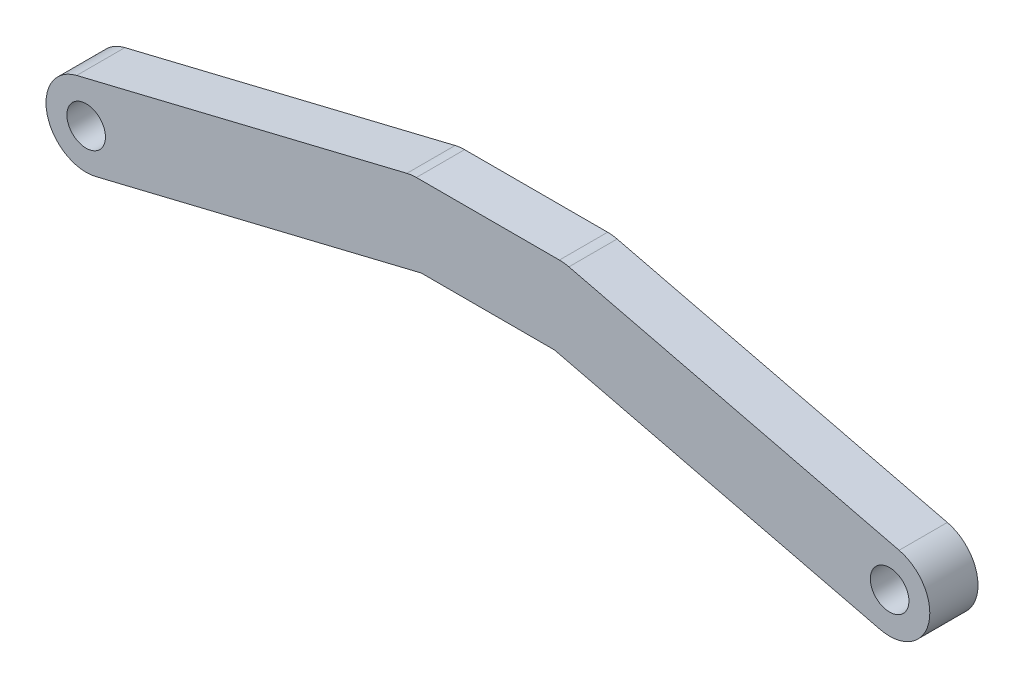
ISO-10303-21;
HEADER;
FILE_DESCRIPTION(('STEP AP214'),'2;1');
FILE_NAME('part.step','',(''),(''),'','','');
FILE_SCHEMA(('AUTOMOTIVE_DESIGN { 1 0 10303 214 1 1 1 1 }'));
ENDSEC;
DATA;
#1=APPLICATION_CONTEXT('core data for automotive mechanical design processes');
#2=APPLICATION_PROTOCOL_DEFINITION('international standard','automotive_design',2000,#1);
#3=PRODUCT_CONTEXT('',#1,'mechanical');
#4=PRODUCT('Part','Part','',(#3));
#5=PRODUCT_RELATED_PRODUCT_CATEGORY('part','',(#4));
#6=PRODUCT_DEFINITION_FORMATION('','',#4);
#7=PRODUCT_DEFINITION_CONTEXT('part definition',#1,'design');
#8=PRODUCT_DEFINITION('design','',#6,#7);
#9=PRODUCT_DEFINITION_SHAPE('','',#8);
#10=(LENGTH_UNIT() NAMED_UNIT(*) SI_UNIT(.MILLI.,.METRE.));
#11=(NAMED_UNIT(*) PLANE_ANGLE_UNIT() SI_UNIT($,.RADIAN.));
#12=(NAMED_UNIT(*) SI_UNIT($,.STERADIAN.) SOLID_ANGLE_UNIT());
#13=UNCERTAINTY_MEASURE_WITH_UNIT(LENGTH_MEASURE(1.E-05),#10,'distance_accuracy_value','');
#14=(GEOMETRIC_REPRESENTATION_CONTEXT(3) GLOBAL_UNCERTAINTY_ASSIGNED_CONTEXT((#13)) GLOBAL_UNIT_ASSIGNED_CONTEXT((#10,
#11,#12)) REPRESENTATION_CONTEXT('',''));
#15=CARTESIAN_POINT('',(0.,0.,0.));
#16=DIRECTION('',(0.,0.,1.));
#17=DIRECTION('',(1.,0.,0.));
#18=AXIS2_PLACEMENT_3D('',#15,#16,#17);
#19=CARTESIAN_POINT('',(-1.98831371703527,8.17192018402959,1.5));
#20=DIRECTION('',(-0.236413248089907,0.971652600535593,0.));
#21=DIRECTION('',(-0.971652600535593,-0.236413248089907,0.));
#22=AXIS2_PLACEMENT_3D('',#19,#20,#21);
#23=PLANE('',#22);
#24=DIRECTION('',(0.971652600535593,0.236413248089907,0.));
#25=VECTOR('',#24,1.);
#26=CARTESIAN_POINT('',(-1.98831371703527,8.17192018402959,-1.5));
#27=LINE('',#26,#25);
#28=CARTESIAN_POINT('',(-25.5910331202248,2.42913150133898,-1.5));
#29=VERTEX_POINT('',#28);
#30=CARTESIAN_POINT('',(-5.04115682551566,7.42913150133898,-1.5));
#31=VERTEX_POINT('',#30);
#32=EDGE_CURVE('E153',#29,#31,#27,.T.);
#33=ORIENTED_EDGE('',*,*,#32,.F.);
#34=DIRECTION('',(0.,0.,-1.));
#35=VECTOR('',#34,1.);
#36=CARTESIAN_POINT('',(-25.5910331202248,2.42913150133898,1.5));
#37=LINE('',#36,#35);
#38=CARTESIAN_POINT('',(-25.5910331202248,2.42913150133898,1.5));
#39=VERTEX_POINT('',#38);
#40=EDGE_CURVE('E11',#39,#29,#37,.T.);
#41=ORIENTED_EDGE('',*,*,#40,.F.);
#42=DIRECTION('',(0.971652600535593,0.236413248089907,0.));
#43=VECTOR('',#42,1.);
#44=CARTESIAN_POINT('',(-1.98831371703527,8.17192018402959,1.5));
#45=LINE('',#44,#43);
#46=CARTESIAN_POINT('',(-5.04115682551566,7.42913150133898,1.5));
#47=VERTEX_POINT('',#46);
#48=EDGE_CURVE('E180',#39,#47,#45,.T.);
#49=ORIENTED_EDGE('',*,*,#48,.T.);
#50=DIRECTION('',(0.,0.,-1.));
#51=VECTOR('',#50,1.);
#52=CARTESIAN_POINT('',(-5.04115682551566,7.42913150133898,1.5));
#53=LINE('',#52,#51);
#54=EDGE_CURVE('E98',#47,#31,#53,.T.);
#55=ORIENTED_EDGE('',*,*,#54,.T.);
#56=EDGE_LOOP('',(#33,#41,#49,#55));
#57=FACE_BOUND('',#56,.T.);
#58=ADVANCED_FACE('F41',(#57),#23,.T.);
#59=CARTESIAN_POINT('',(-25.,0.,1.5));
#60=DIRECTION('',(0.,0.,-1.));
#61=DIRECTION('',(-1.,0.,0.));
#62=AXIS2_PLACEMENT_3D('',#59,#60,#61);
#63=CYLINDRICAL_SURFACE('',#62,2.5);
#64=CARTESIAN_POINT('',(-25.,0.,-1.5));
#65=DIRECTION('',(0.,0.,1.));
#66=DIRECTION('',(1.,0.,0.));
#67=AXIS2_PLACEMENT_3D('',#64,#65,#66);
#68=CIRCLE('',#67,2.5);
#69=CARTESIAN_POINT('',(-24.4089668797752,-2.42913150133898,-1.5));
#70=VERTEX_POINT('',#69);
#71=EDGE_CURVE('E156',#29,#70,#68,.T.);
#72=ORIENTED_EDGE('',*,*,#71,.T.);
#73=DIRECTION('',(0.,0.,-1.));
#74=VECTOR('',#73,1.);
#75=CARTESIAN_POINT('',(-24.4089668797752,-2.42913150133898,1.5));
#76=LINE('',#75,#74);
#77=CARTESIAN_POINT('',(-24.4089668797752,-2.42913150133898,1.5));
#78=VERTEX_POINT('',#77);
#79=EDGE_CURVE('E49',#78,#70,#76,.T.);
#80=ORIENTED_EDGE('',*,*,#79,.F.);
#81=CARTESIAN_POINT('',(-25.,0.,1.5));
#82=DIRECTION('',(0.,0.,1.));
#83=DIRECTION('',(1.,0.,0.));
#84=AXIS2_PLACEMENT_3D('',#81,#82,#83);
#85=CIRCLE('',#84,2.5);
#86=EDGE_CURVE('E220',#39,#78,#85,.T.);
#87=ORIENTED_EDGE('',*,*,#86,.F.);
#88=ORIENTED_EDGE('',*,*,#40,.T.);
#89=EDGE_LOOP('',(#72,#80,#87,#88));
#90=FACE_BOUND('',#89,.T.);
#91=ADVANCED_FACE('F235',(#90),#63,.T.);
#92=CARTESIAN_POINT('',(-0.806247476585729,3.31365718135163,1.5));
#93=DIRECTION('',(-0.236413248089907,0.971652600535593,0.));
#94=DIRECTION('',(-0.971652600535593,-0.236413248089907,0.));
#95=AXIS2_PLACEMENT_3D('',#92,#93,#94);
#96=PLANE('',#95);
#97=DIRECTION('',(0.971652600535593,0.236413248089907,0.));
#98=VECTOR('',#97,1.);
#99=CARTESIAN_POINT('',(-0.806247476585729,3.31365718135163,-1.5));
#100=LINE('',#99,#98);
#101=CARTESIAN_POINT('',(-4.15035836120124,2.5,-1.5));
#102=VERTEX_POINT('',#101);
#103=EDGE_CURVE('E158',#70,#102,#100,.T.);
#104=ORIENTED_EDGE('',*,*,#103,.T.);
#105=DIRECTION('',(0.,0.,-1.));
#106=VECTOR('',#105,1.);
#107=CARTESIAN_POINT('',(-4.15035836120124,2.5,1.5));
#108=LINE('',#107,#106);
#109=CARTESIAN_POINT('',(-4.15035836120124,2.5,1.5));
#110=VERTEX_POINT('',#109);
#111=EDGE_CURVE('E191',#110,#102,#108,.T.);
#112=ORIENTED_EDGE('',*,*,#111,.F.);
#113=DIRECTION('',(0.971652600535593,0.236413248089907,0.));
#114=VECTOR('',#113,1.);
#115=CARTESIAN_POINT('',(-0.806247476585729,3.31365718135163,1.5));
#116=LINE('',#115,#114);
#117=EDGE_CURVE('E200',#78,#110,#116,.T.);
#118=ORIENTED_EDGE('',*,*,#117,.F.);
#119=ORIENTED_EDGE('',*,*,#79,.T.);
#120=EDGE_LOOP('',(#104,#112,#118,#119));
#121=FACE_BOUND('',#120,.T.);
#122=ADVANCED_FACE('F198',(#121),#96,.F.);
#123=CARTESIAN_POINT('',(0.,2.5,1.5));
#124=DIRECTION('',(0.,1.,0.));
#125=DIRECTION('',(-1.,0.,0.));
#126=AXIS2_PLACEMENT_3D('',#123,#124,#125);
#127=PLANE('',#126);
#128=DIRECTION('',(1.,0.,0.));
#129=VECTOR('',#128,1.);
#130=CARTESIAN_POINT('',(0.,2.5,-1.5));
#131=LINE('',#130,#129);
#132=CARTESIAN_POINT('',(4.15035836120123,2.50000000000001,-1.5));
#133=VERTEX_POINT('',#132);
#134=EDGE_CURVE('E160',#102,#133,#131,.T.);
#135=ORIENTED_EDGE('',*,*,#134,.T.);
#136=DIRECTION('',(0.,0.,-1.));
#137=VECTOR('',#136,1.);
#138=CARTESIAN_POINT('',(4.15035836120123,2.50000000000001,1.5));
#139=LINE('',#138,#137);
#140=CARTESIAN_POINT('',(4.15035836120123,2.50000000000001,1.5));
#141=VERTEX_POINT('',#140);
#142=EDGE_CURVE('E189',#141,#133,#139,.T.);
#143=ORIENTED_EDGE('',*,*,#142,.F.);
#144=DIRECTION('',(1.,0.,0.));
#145=VECTOR('',#144,1.);
#146=CARTESIAN_POINT('',(0.,2.5,1.5));
#147=LINE('',#146,#145);
#148=EDGE_CURVE('E214',#110,#141,#147,.T.);
#149=ORIENTED_EDGE('',*,*,#148,.F.);
#150=ORIENTED_EDGE('',*,*,#111,.T.);
#151=EDGE_LOOP('',(#135,#143,#149,#150));
#152=FACE_BOUND('',#151,.T.);
#153=ADVANCED_FACE('F211',(#152),#127,.F.);
#154=CARTESIAN_POINT('',(0.806247476585728,3.31365718135163,1.5));
#155=DIRECTION('',(-0.236413248089906,-0.971652600535593,0.));
#156=DIRECTION('',(0.971652600535593,-0.236413248089906,0.));
#157=AXIS2_PLACEMENT_3D('',#154,#155,#156);
#158=PLANE('',#157);
#159=DIRECTION('',(-0.971652600535593,0.236413248089906,0.));
#160=VECTOR('',#159,1.);
#161=CARTESIAN_POINT('',(0.806247476585728,3.31365718135163,-1.5));
#162=LINE('',#161,#160);
#163=CARTESIAN_POINT('',(24.4089668797752,-2.42913150133897,-1.5));
#164=VERTEX_POINT('',#163);
#165=EDGE_CURVE('E163',#164,#133,#162,.T.);
#166=ORIENTED_EDGE('',*,*,#165,.F.);
#167=DIRECTION('',(0.,0.,-1.));
#168=VECTOR('',#167,1.);
#169=CARTESIAN_POINT('',(24.4089668797752,-2.42913150133897,1.5));
#170=LINE('',#169,#168);
#171=CARTESIAN_POINT('',(24.4089668797752,-2.42913150133897,1.5));
#172=VERTEX_POINT('',#171);
#173=EDGE_CURVE('E187',#172,#164,#170,.T.);
#174=ORIENTED_EDGE('',*,*,#173,.F.);
#175=DIRECTION('',(-0.971652600535593,0.236413248089906,0.));
#176=VECTOR('',#175,1.);
#177=CARTESIAN_POINT('',(0.806247476585728,3.31365718135163,1.5));
#178=LINE('',#177,#176);
#179=EDGE_CURVE('E216',#172,#141,#178,.T.);
#180=ORIENTED_EDGE('',*,*,#179,.T.);
#181=ORIENTED_EDGE('',*,*,#142,.T.);
#182=EDGE_LOOP('',(#166,#174,#180,#181));
#183=FACE_BOUND('',#182,.T.);
#184=ADVANCED_FACE('F245',(#183),#158,.T.);
#185=CARTESIAN_POINT('',(25.,0.,1.5));
#186=DIRECTION('',(0.,0.,-1.));
#187=DIRECTION('',(-1.,0.,0.));
#188=AXIS2_PLACEMENT_3D('',#185,#186,#187);
#189=CYLINDRICAL_SURFACE('',#188,2.5);
#190=CARTESIAN_POINT('',(25.,0.,-1.5));
#191=DIRECTION('',(0.,0.,1.));
#192=DIRECTION('',(1.,0.,0.));
#193=AXIS2_PLACEMENT_3D('',#190,#191,#192);
#194=CIRCLE('',#193,2.5);
#195=CARTESIAN_POINT('',(25.5910331202248,2.42913150133899,-1.5));
#196=VERTEX_POINT('',#195);
#197=EDGE_CURVE('E166',#164,#196,#194,.T.);
#198=ORIENTED_EDGE('',*,*,#197,.T.);
#199=DIRECTION('',(0.,0.,-1.));
#200=VECTOR('',#199,1.);
#201=CARTESIAN_POINT('',(25.5910331202248,2.42913150133899,1.5));
#202=LINE('',#201,#200);
#203=CARTESIAN_POINT('',(25.5910331202248,2.42913150133899,1.5));
#204=VERTEX_POINT('',#203);
#205=EDGE_CURVE('E184',#204,#196,#202,.T.);
#206=ORIENTED_EDGE('',*,*,#205,.F.);
#207=CARTESIAN_POINT('',(25.,0.,1.5));
#208=DIRECTION('',(0.,0.,1.));
#209=DIRECTION('',(1.,0.,0.));
#210=AXIS2_PLACEMENT_3D('',#207,#208,#209);
#211=CIRCLE('',#210,2.5);
#212=EDGE_CURVE('E218',#172,#204,#211,.T.);
#213=ORIENTED_EDGE('',*,*,#212,.F.);
#214=ORIENTED_EDGE('',*,*,#173,.T.);
#215=EDGE_LOOP('',(#198,#206,#213,#214));
#216=FACE_BOUND('',#215,.T.);
#217=ADVANCED_FACE('F227',(#216),#189,.T.);
#218=CARTESIAN_POINT('',(1.98831371703526,8.1719201840296,1.5));
#219=DIRECTION('',(-0.236413248089907,-0.971652600535593,0.));
#220=DIRECTION('',(0.971652600535593,-0.236413248089907,0.));
#221=AXIS2_PLACEMENT_3D('',#218,#219,#220);
#222=PLANE('',#221);
#223=DIRECTION('',(-0.971652600535593,0.236413248089907,0.));
#224=VECTOR('',#223,1.);
#225=CARTESIAN_POINT('',(1.98831371703526,8.1719201840296,-1.5));
#226=LINE('',#225,#224);
#227=CARTESIAN_POINT('',(5.04115682551566,7.42913150133899,-1.5));
#228=VERTEX_POINT('',#227);
#229=EDGE_CURVE('E168',#196,#228,#226,.T.);
#230=ORIENTED_EDGE('',*,*,#229,.T.);
#231=DIRECTION('',(0.,0.,-1.));
#232=VECTOR('',#231,1.);
#233=CARTESIAN_POINT('',(5.04115682551566,7.42913150133899,1.5));
#234=LINE('',#233,#232);
#235=CARTESIAN_POINT('',(5.04115682551566,7.42913150133899,1.5));
#236=VERTEX_POINT('',#235);
#237=EDGE_CURVE('E139',#236,#228,#234,.T.);
#238=ORIENTED_EDGE('',*,*,#237,.F.);
#239=DIRECTION('',(-0.971652600535593,0.236413248089907,0.));
#240=VECTOR('',#239,1.);
#241=CARTESIAN_POINT('',(1.98831371703526,8.1719201840296,1.5));
#242=LINE('',#241,#240);
#243=EDGE_CURVE('E130',#204,#236,#242,.T.);
#244=ORIENTED_EDGE('',*,*,#243,.F.);
#245=ORIENTED_EDGE('',*,*,#205,.T.);
#246=EDGE_LOOP('',(#230,#238,#244,#245));
#247=FACE_BOUND('',#246,.T.);
#248=ADVANCED_FACE('F230',(#247),#222,.F.);
#249=CARTESIAN_POINT('',(4.45012370529089,5.,1.5));
#250=DIRECTION('',(0.,0.,-1.));
#251=DIRECTION('',(-1.,0.,0.));
#252=AXIS2_PLACEMENT_3D('',#249,#250,#251);
#253=CYLINDRICAL_SURFACE('',#252,2.5);
#254=CARTESIAN_POINT('',(4.45012370529089,5.,-1.5));
#255=DIRECTION('',(0.,0.,1.));
#256=DIRECTION('',(1.,0.,0.));
#257=AXIS2_PLACEMENT_3D('',#254,#255,#256);
#258=CIRCLE('',#257,2.5);
#259=CARTESIAN_POINT('',(4.45012370529089,7.5,-1.5));
#260=VERTEX_POINT('',#259);
#261=EDGE_CURVE('E138',#228,#260,#258,.T.);
#262=ORIENTED_EDGE('',*,*,#261,.T.);
#263=DIRECTION('',(0.,0.,-1.));
#264=VECTOR('',#263,1.);
#265=CARTESIAN_POINT('',(4.45012370529089,7.5,1.5));
#266=LINE('',#265,#264);
#267=CARTESIAN_POINT('',(4.45012370529089,7.5,1.5));
#268=VERTEX_POINT('',#267);
#269=EDGE_CURVE('E135',#268,#260,#266,.T.);
#270=ORIENTED_EDGE('',*,*,#269,.F.);
#271=CARTESIAN_POINT('',(4.45012370529089,5.,1.5));
#272=DIRECTION('',(0.,0.,1.));
#273=DIRECTION('',(1.,0.,0.));
#274=AXIS2_PLACEMENT_3D('',#271,#272,#273);
#275=CIRCLE('',#274,2.5);
#276=EDGE_CURVE('E123',#236,#268,#275,.T.);
#277=ORIENTED_EDGE('',*,*,#276,.F.);
#278=ORIENTED_EDGE('',*,*,#237,.T.);
#279=EDGE_LOOP('',(#262,#270,#277,#278));
#280=FACE_BOUND('',#279,.T.);
#281=ADVANCED_FACE('F136',(#280),#253,.T.);
#282=CARTESIAN_POINT('',(0.,7.5,1.5));
#283=DIRECTION('',(0.,-1.,0.));
#284=DIRECTION('',(1.,0.,0.));
#285=AXIS2_PLACEMENT_3D('',#282,#283,#284);
#286=PLANE('',#285);
#287=DIRECTION('',(-1.,0.,0.));
#288=VECTOR('',#287,1.);
#289=CARTESIAN_POINT('',(0.,7.5,-1.5));
#290=LINE('',#289,#288);
#291=CARTESIAN_POINT('',(-4.45012370529089,7.5,-1.5));
#292=VERTEX_POINT('',#291);
#293=EDGE_CURVE('E91',#260,#292,#290,.T.);
#294=ORIENTED_EDGE('',*,*,#293,.T.);
#295=DIRECTION('',(0.,0.,-1.));
#296=VECTOR('',#295,1.);
#297=CARTESIAN_POINT('',(-4.45012370529089,7.5,1.5));
#298=LINE('',#297,#296);
#299=CARTESIAN_POINT('',(-4.45012370529089,7.5,1.5));
#300=VERTEX_POINT('',#299);
#301=EDGE_CURVE('E140',#300,#292,#298,.T.);
#302=ORIENTED_EDGE('',*,*,#301,.F.);
#303=DIRECTION('',(-1.,0.,0.));
#304=VECTOR('',#303,1.);
#305=CARTESIAN_POINT('',(0.,7.5,1.5));
#306=LINE('',#305,#304);
#307=EDGE_CURVE('E128',#268,#300,#306,.T.);
#308=ORIENTED_EDGE('',*,*,#307,.F.);
#309=ORIENTED_EDGE('',*,*,#269,.T.);
#310=EDGE_LOOP('',(#294,#302,#308,#309));
#311=FACE_BOUND('',#310,.T.);
#312=ADVANCED_FACE('F142',(#311),#286,.F.);
#313=CARTESIAN_POINT('',(25.,0.,1.5));
#314=DIRECTION('',(0.,0.,-1.));
#315=DIRECTION('',(-1.,0.,0.));
#316=AXIS2_PLACEMENT_3D('',#313,#314,#315);
#317=CYLINDRICAL_SURFACE('',#316,1.2);
#318=CARTESIAN_POINT('',(25.,0.,1.5));
#319=DIRECTION('',(0.,0.,1.));
#320=DIRECTION('',(1.,0.,0.));
#321=AXIS2_PLACEMENT_3D('',#318,#319,#320);
#322=CIRCLE('',#321,1.2);
#323=CARTESIAN_POINT('',(26.2,0.,1.5));
#324=VERTEX_POINT('',#323);
#325=EDGE_CURVE('E144',#324,#324,#322,.T.);
#326=ORIENTED_EDGE('',*,*,#325,.T.);
#327=EDGE_LOOP('',(#326));
#328=FACE_BOUND('',#327,.T.);
#329=CARTESIAN_POINT('',(25.,0.,-1.5));
#330=DIRECTION('',(0.,0.,1.));
#331=DIRECTION('',(1.,0.,0.));
#332=AXIS2_PLACEMENT_3D('',#329,#330,#331);
#333=CIRCLE('',#332,1.2);
#334=CARTESIAN_POINT('',(26.2,0.,-1.5));
#335=VERTEX_POINT('',#334);
#336=EDGE_CURVE('E174',#335,#335,#333,.T.);
#337=ORIENTED_EDGE('',*,*,#336,.F.);
#338=EDGE_LOOP('',(#337));
#339=FACE_BOUND('',#338,.T.);
#340=ADVANCED_FACE('F257',(#328,#339),#317,.F.);
#341=CARTESIAN_POINT('',(-4.45012370529089,5.,1.5));
#342=DIRECTION('',(0.,0.,-1.));
#343=DIRECTION('',(-1.,0.,0.));
#344=AXIS2_PLACEMENT_3D('',#341,#342,#343);
#345=CYLINDRICAL_SURFACE('',#344,2.5);
#346=CARTESIAN_POINT('',(-4.45012370529089,5.,-1.5));
#347=DIRECTION('',(0.,0.,1.));
#348=DIRECTION('',(1.,0.,0.));
#349=AXIS2_PLACEMENT_3D('',#346,#347,#348);
#350=CIRCLE('',#349,2.5);
#351=EDGE_CURVE('E172',#292,#31,#350,.T.);
#352=ORIENTED_EDGE('',*,*,#351,.T.);
#353=ORIENTED_EDGE('',*,*,#54,.F.);
#354=CARTESIAN_POINT('',(-4.45012370529089,5.,1.5));
#355=DIRECTION('',(0.,0.,1.));
#356=DIRECTION('',(1.,0.,0.));
#357=AXIS2_PLACEMENT_3D('',#354,#355,#356);
#358=CIRCLE('',#357,2.5);
#359=EDGE_CURVE('E57',#300,#47,#358,.T.);
#360=ORIENTED_EDGE('',*,*,#359,.F.);
#361=ORIENTED_EDGE('',*,*,#301,.T.);
#362=EDGE_LOOP('',(#352,#353,#360,#361));
#363=FACE_BOUND('',#362,.T.);
#364=ADVANCED_FACE('F233',(#363),#345,.T.);
#365=CARTESIAN_POINT('',(-25.,0.,1.5));
#366=DIRECTION('',(0.,0.,-1.));
#367=DIRECTION('',(-1.,0.,0.));
#368=AXIS2_PLACEMENT_3D('',#365,#366,#367);
#369=CYLINDRICAL_SURFACE('',#368,1.2);
#370=CARTESIAN_POINT('',(-25.,0.,1.5));
#371=DIRECTION('',(0.,0.,1.));
#372=DIRECTION('',(1.,0.,0.));
#373=AXIS2_PLACEMENT_3D('',#370,#371,#372);
#374=CIRCLE('',#373,1.2);
#375=CARTESIAN_POINT('',(-23.8,0.,1.5));
#376=VERTEX_POINT('',#375);
#377=EDGE_CURVE('E150',#376,#376,#374,.T.);
#378=ORIENTED_EDGE('',*,*,#377,.T.);
#379=EDGE_LOOP('',(#378));
#380=FACE_BOUND('',#379,.T.);
#381=CARTESIAN_POINT('',(-25.,0.,-1.5));
#382=DIRECTION('',(0.,0.,1.));
#383=DIRECTION('',(1.,0.,0.));
#384=AXIS2_PLACEMENT_3D('',#381,#382,#383);
#385=CIRCLE('',#384,1.2);
#386=CARTESIAN_POINT('',(-23.8,0.,-1.5));
#387=VERTEX_POINT('',#386);
#388=EDGE_CURVE('E177',#387,#387,#385,.T.);
#389=ORIENTED_EDGE('',*,*,#388,.F.);
#390=EDGE_LOOP('',(#389));
#391=FACE_BOUND('',#390,.T.);
#392=ADVANCED_FACE('F260',(#380,#391),#369,.F.);
#393=CARTESIAN_POINT('',(0.,0.,1.5));
#394=DIRECTION('',(0.,0.,1.));
#395=DIRECTION('',(1.,0.,0.));
#396=AXIS2_PLACEMENT_3D('',#393,#394,#395);
#397=PLANE('',#396);
#398=ORIENTED_EDGE('',*,*,#48,.F.);
#399=ORIENTED_EDGE('',*,*,#86,.T.);
#400=ORIENTED_EDGE('',*,*,#117,.T.);
#401=ORIENTED_EDGE('',*,*,#148,.T.);
#402=ORIENTED_EDGE('',*,*,#179,.F.);
#403=ORIENTED_EDGE('',*,*,#212,.T.);
#404=ORIENTED_EDGE('',*,*,#243,.T.);
#405=ORIENTED_EDGE('',*,*,#276,.T.);
#406=ORIENTED_EDGE('',*,*,#307,.T.);
#407=ORIENTED_EDGE('',*,*,#359,.T.);
#408=EDGE_LOOP('',(#398,#399,#400,#401,#402,#403,#404,#405,#406,#407));
#409=FACE_BOUND('',#408,.T.);
#410=ORIENTED_EDGE('',*,*,#325,.F.);
#411=EDGE_LOOP('',(#410));
#412=FACE_BOUND('',#411,.T.);
#413=ORIENTED_EDGE('',*,*,#377,.F.);
#414=EDGE_LOOP('',(#413));
#415=FACE_BOUND('',#414,.T.);
#416=ADVANCED_FACE('F125',(#409,#412,#415),#397,.T.);
#417=CARTESIAN_POINT('',(0.,0.,-1.5));
#418=DIRECTION('',(0.,0.,1.));
#419=DIRECTION('',(1.,0.,0.));
#420=AXIS2_PLACEMENT_3D('',#417,#418,#419);
#421=PLANE('',#420);
#422=ORIENTED_EDGE('',*,*,#32,.T.);
#423=ORIENTED_EDGE('',*,*,#351,.F.);
#424=ORIENTED_EDGE('',*,*,#293,.F.);
#425=ORIENTED_EDGE('',*,*,#261,.F.);
#426=ORIENTED_EDGE('',*,*,#229,.F.);
#427=ORIENTED_EDGE('',*,*,#197,.F.);
#428=ORIENTED_EDGE('',*,*,#165,.T.);
#429=ORIENTED_EDGE('',*,*,#134,.F.);
#430=ORIENTED_EDGE('',*,*,#103,.F.);
#431=ORIENTED_EDGE('',*,*,#71,.F.);
#432=EDGE_LOOP('',(#422,#423,#424,#425,#426,#427,#428,#429,#430,#431));
#433=FACE_BOUND('',#432,.T.);
#434=ORIENTED_EDGE('',*,*,#336,.T.);
#435=EDGE_LOOP('',(#434));
#436=FACE_BOUND('',#435,.T.);
#437=ORIENTED_EDGE('',*,*,#388,.T.);
#438=EDGE_LOOP('',(#437));
#439=FACE_BOUND('',#438,.T.);
#440=ADVANCED_FACE('F205',(#433,#436,#439),#421,.F.);
#441=CLOSED_SHELL('',(#58,#91,#122,#153,#184,#217,#248,#281,#312,#340,#364,#392,#416,#440));
#442=MANIFOLD_SOLID_BREP('B2',#441);
#443=ADVANCED_BREP_SHAPE_REPRESENTATION('',(#18,#442),#14);
#444=SHAPE_DEFINITION_REPRESENTATION(#9,#443);
ENDSEC;
END-ISO-10303-21;
